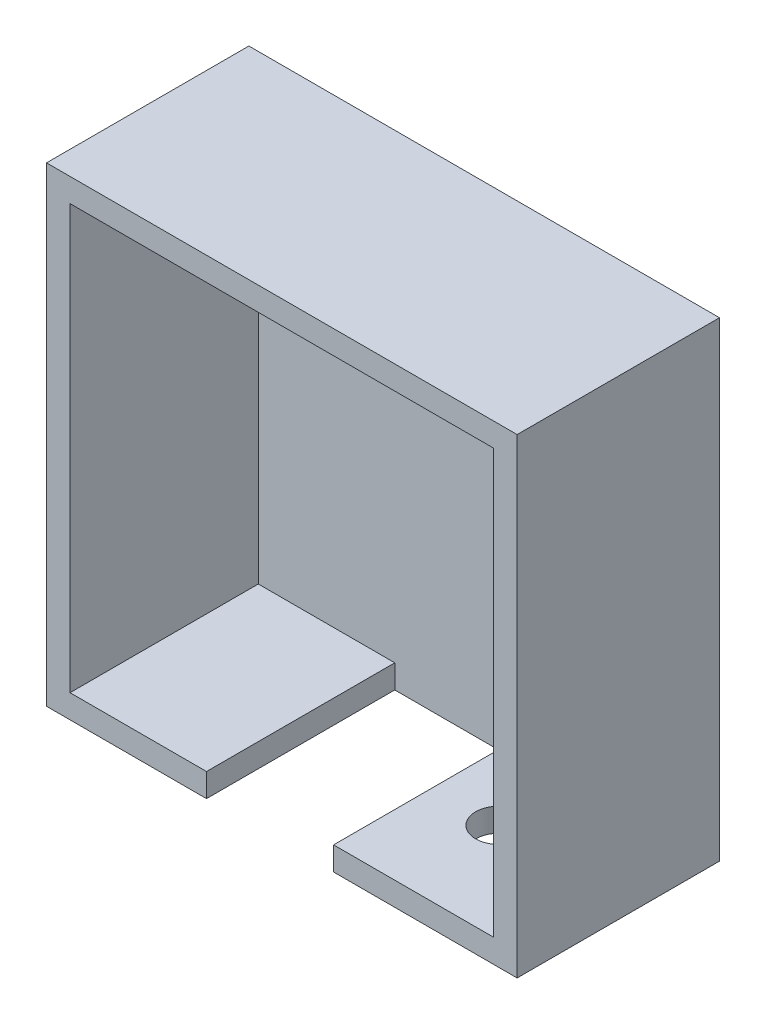
ISO-10303-21;
HEADER;
FILE_DESCRIPTION(('STEP AP214'),'2;1');
FILE_NAME('part.step','',(''),(''),'','','');
FILE_SCHEMA(('AUTOMOTIVE_DESIGN { 1 0 10303 214 1 1 1 1 }'));
ENDSEC;
DATA;
#1=APPLICATION_CONTEXT('core data for automotive mechanical design processes');
#2=APPLICATION_PROTOCOL_DEFINITION('international standard','automotive_design',2000,#1);
#3=PRODUCT_CONTEXT('',#1,'mechanical');
#4=PRODUCT('Part','Part','',(#3));
#5=PRODUCT_RELATED_PRODUCT_CATEGORY('part','',(#4));
#6=PRODUCT_DEFINITION_FORMATION('','',#4);
#7=PRODUCT_DEFINITION_CONTEXT('part definition',#1,'design');
#8=PRODUCT_DEFINITION('design','',#6,#7);
#9=PRODUCT_DEFINITION_SHAPE('','',#8);
#10=(LENGTH_UNIT() NAMED_UNIT(*) SI_UNIT(.MILLI.,.METRE.));
#11=(NAMED_UNIT(*) PLANE_ANGLE_UNIT() SI_UNIT($,.RADIAN.));
#12=(NAMED_UNIT(*) SI_UNIT($,.STERADIAN.) SOLID_ANGLE_UNIT());
#13=UNCERTAINTY_MEASURE_WITH_UNIT(LENGTH_MEASURE(1.E-05),#10,'distance_accuracy_value','');
#14=(GEOMETRIC_REPRESENTATION_CONTEXT(3) GLOBAL_UNCERTAINTY_ASSIGNED_CONTEXT((#13)) GLOBAL_UNIT_ASSIGNED_CONTEXT((#10,
#11,#12)) REPRESENTATION_CONTEXT('',''));
#15=CARTESIAN_POINT('',(0.,0.,0.));
#16=DIRECTION('',(0.,0.,1.));
#17=DIRECTION('',(1.,0.,0.));
#18=AXIS2_PLACEMENT_3D('',#15,#16,#17);
#19=CARTESIAN_POINT('',(0.,0.,3.));
#20=DIRECTION('',(1.,0.,0.));
#21=DIRECTION('',(0.,1.,0.));
#22=AXIS2_PLACEMENT_3D('',#19,#20,#21);
#23=PLANE('',#22);
#24=DIRECTION('',(0.,-1.,0.));
#25=VECTOR('',#24,1.);
#26=CARTESIAN_POINT('',(0.,0.,0.));
#27=LINE('',#26,#25);
#28=CARTESIAN_POINT('',(0.,0.,0.));
#29=VERTEX_POINT('',#28);
#30=CARTESIAN_POINT('',(0.,-100.,0.));
#31=VERTEX_POINT('',#30);
#32=EDGE_CURVE('E124',#29,#31,#27,.T.);
#33=ORIENTED_EDGE('',*,*,#32,.T.);
#34=DIRECTION('',(0.,0.,-1.));
#35=VECTOR('',#34,1.);
#36=CARTESIAN_POINT('',(0.,-100.,3.));
#37=LINE('',#36,#35);
#38=CARTESIAN_POINT('',(0.,-100.,43.));
#39=VERTEX_POINT('',#38);
#40=EDGE_CURVE('E11',#39,#31,#37,.T.);
#41=ORIENTED_EDGE('',*,*,#40,.F.);
#42=DIRECTION('',(0.,-1.,0.));
#43=VECTOR('',#42,1.);
#44=CARTESIAN_POINT('',(0.,0.,43.));
#45=LINE('',#44,#43);
#46=CARTESIAN_POINT('',(0.,0.,43.));
#47=VERTEX_POINT('',#46);
#48=EDGE_CURVE('E122',#47,#39,#45,.T.);
#49=ORIENTED_EDGE('',*,*,#48,.F.);
#50=DIRECTION('',(0.,0.,-1.));
#51=VECTOR('',#50,1.);
#52=CARTESIAN_POINT('',(0.,0.,3.));
#53=LINE('',#52,#51);
#54=EDGE_CURVE('E204',#47,#29,#53,.T.);
#55=ORIENTED_EDGE('',*,*,#54,.T.);
#56=EDGE_LOOP('',(#33,#41,#49,#55));
#57=FACE_BOUND('',#56,.T.);
#58=ADVANCED_FACE('F33',(#57),#23,.F.);
#59=CARTESIAN_POINT('',(0.,-100.,3.));
#60=DIRECTION('',(0.,1.,0.));
#61=DIRECTION('',(0.,0.,1.));
#62=AXIS2_PLACEMENT_3D('',#59,#60,#61);
#63=PLANE('',#62);
#64=CARTESIAN_POINT('',(75.,-100.,21.8065219628252));
#65=DIRECTION('',(0.,-1.,0.));
#66=DIRECTION('',(0.,0.,-1.));
#67=AXIS2_PLACEMENT_3D('',#64,#65,#66);
#68=CIRCLE('',#67,4.99999999999999);
#69=CARTESIAN_POINT('',(75.,-100.,16.8065219628252));
#70=VERTEX_POINT('',#69);
#71=EDGE_CURVE('E362',#70,#70,#68,.T.);
#72=ORIENTED_EDGE('',*,*,#71,.F.);
#73=EDGE_LOOP('',(#72));
#74=FACE_BOUND('',#73,.T.);
#75=DIRECTION('',(1.,0.,0.));
#76=VECTOR('',#75,1.);
#77=CARTESIAN_POINT('',(0.,-100.,0.));
#78=LINE('',#77,#76);
#79=CARTESIAN_POINT('',(100.,-100.,0.));
#80=VERTEX_POINT('',#79);
#81=EDGE_CURVE('E207',#31,#80,#78,.T.);
#82=ORIENTED_EDGE('',*,*,#81,.T.);
#83=DIRECTION('',(0.,0.,-1.));
#84=VECTOR('',#83,1.);
#85=CARTESIAN_POINT('',(100.,-100.,3.));
#86=LINE('',#85,#84);
#87=CARTESIAN_POINT('',(100.,-100.,43.));
#88=VERTEX_POINT('',#87);
#89=EDGE_CURVE('E41',#88,#80,#86,.T.);
#90=ORIENTED_EDGE('',*,*,#89,.F.);
#91=DIRECTION('',(1.,0.,0.));
#92=VECTOR('',#91,1.);
#93=CARTESIAN_POINT('',(61.,-100.,43.));
#94=LINE('',#93,#92);
#95=CARTESIAN_POINT('',(61.,-100.,43.));
#96=VERTEX_POINT('',#95);
#97=EDGE_CURVE('E158',#96,#88,#94,.T.);
#98=ORIENTED_EDGE('',*,*,#97,.F.);
#99=DIRECTION('',(0.,0.,-1.));
#100=VECTOR('',#99,1.);
#101=CARTESIAN_POINT('',(61.,-100.,43.));
#102=LINE('',#101,#100);
#103=CARTESIAN_POINT('',(61.,-100.,3.));
#104=VERTEX_POINT('',#103);
#105=EDGE_CURVE('E164',#96,#104,#102,.T.);
#106=ORIENTED_EDGE('',*,*,#105,.T.);
#107=DIRECTION('',(1.,0.,0.));
#108=VECTOR('',#107,1.);
#109=CARTESIAN_POINT('',(0.,-100.,3.));
#110=LINE('',#109,#108);
#111=CARTESIAN_POINT('',(34.,-100.,3.));
#112=VERTEX_POINT('',#111);
#113=EDGE_CURVE('E202',#112,#104,#110,.T.);
#114=ORIENTED_EDGE('',*,*,#113,.F.);
#115=DIRECTION('',(0.,0.,-1.));
#116=VECTOR('',#115,1.);
#117=CARTESIAN_POINT('',(34.,-100.,43.));
#118=LINE('',#117,#116);
#119=CARTESIAN_POINT('',(34.,-100.,43.));
#120=VERTEX_POINT('',#119);
#121=EDGE_CURVE('E139',#120,#112,#118,.T.);
#122=ORIENTED_EDGE('',*,*,#121,.F.);
#123=DIRECTION('',(1.,0.,0.));
#124=VECTOR('',#123,1.);
#125=CARTESIAN_POINT('',(0.,-100.,43.));
#126=LINE('',#125,#124);
#127=EDGE_CURVE('E130',#39,#120,#126,.T.);
#128=ORIENTED_EDGE('',*,*,#127,.F.);
#129=ORIENTED_EDGE('',*,*,#40,.T.);
#130=EDGE_LOOP('',(#82,#90,#98,#106,#114,#122,#128,#129));
#131=FACE_BOUND('',#130,.T.);
#132=ADVANCED_FACE('F136',(#74,#131),#63,.F.);
#133=CARTESIAN_POINT('',(100.,0.,3.));
#134=DIRECTION('',(-1.,0.,0.));
#135=DIRECTION('',(0.,0.,1.));
#136=AXIS2_PLACEMENT_3D('',#133,#134,#135);
#137=PLANE('',#136);
#138=DIRECTION('',(0.,1.,0.));
#139=VECTOR('',#138,1.);
#140=CARTESIAN_POINT('',(100.,0.,0.));
#141=LINE('',#140,#139);
#142=CARTESIAN_POINT('',(100.,0.,0.));
#143=VERTEX_POINT('',#142);
#144=EDGE_CURVE('E209',#80,#143,#141,.T.);
#145=ORIENTED_EDGE('',*,*,#144,.T.);
#146=DIRECTION('',(0.,0.,-1.));
#147=VECTOR('',#146,1.);
#148=CARTESIAN_POINT('',(100.,0.,3.));
#149=LINE('',#148,#147);
#150=CARTESIAN_POINT('',(100.,0.,43.));
#151=VERTEX_POINT('',#150);
#152=EDGE_CURVE('E213',#151,#143,#149,.T.);
#153=ORIENTED_EDGE('',*,*,#152,.F.);
#154=DIRECTION('',(0.,1.,0.));
#155=VECTOR('',#154,1.);
#156=CARTESIAN_POINT('',(100.,-5.00000000000001,43.));
#157=LINE('',#156,#155);
#158=EDGE_CURVE('E161',#88,#151,#157,.T.);
#159=ORIENTED_EDGE('',*,*,#158,.F.);
#160=ORIENTED_EDGE('',*,*,#89,.T.);
#161=EDGE_LOOP('',(#145,#153,#159,#160));
#162=FACE_BOUND('',#161,.T.);
#163=ADVANCED_FACE('F220',(#162),#137,.F.);
#164=CARTESIAN_POINT('',(0.,0.,3.));
#165=DIRECTION('',(0.,-1.,0.));
#166=DIRECTION('',(0.,0.,-1.));
#167=AXIS2_PLACEMENT_3D('',#164,#165,#166);
#168=PLANE('',#167);
#169=DIRECTION('',(-1.,0.,0.));
#170=VECTOR('',#169,1.);
#171=CARTESIAN_POINT('',(0.,0.,0.));
#172=LINE('',#171,#170);
#173=EDGE_CURVE('E205',#143,#29,#172,.T.);
#174=ORIENTED_EDGE('',*,*,#173,.T.);
#175=ORIENTED_EDGE('',*,*,#54,.F.);
#176=DIRECTION('',(-1.,0.,0.));
#177=VECTOR('',#176,1.);
#178=CARTESIAN_POINT('',(0.,0.,43.));
#179=LINE('',#178,#177);
#180=EDGE_CURVE('E134',#151,#47,#179,.T.);
#181=ORIENTED_EDGE('',*,*,#180,.F.);
#182=ORIENTED_EDGE('',*,*,#152,.T.);
#183=EDGE_LOOP('',(#174,#175,#181,#182));
#184=FACE_BOUND('',#183,.T.);
#185=ADVANCED_FACE('F226',(#184),#168,.F.);
#186=CARTESIAN_POINT('',(0.,0.,3.));
#187=DIRECTION('',(0.,0.,1.));
#188=DIRECTION('',(1.,0.,0.));
#189=AXIS2_PLACEMENT_3D('',#186,#187,#188);
#190=PLANE('',#189);
#191=DIRECTION('',(0.,-1.,0.));
#192=VECTOR('',#191,1.);
#193=CARTESIAN_POINT('',(61.,-95.,3.));
#194=LINE('',#193,#192);
#195=CARTESIAN_POINT('',(61.,-95.,3.));
#196=VERTEX_POINT('',#195);
#197=EDGE_CURVE('E48',#196,#104,#194,.T.);
#198=ORIENTED_EDGE('',*,*,#197,.F.);
#199=DIRECTION('',(-1.,0.,0.));
#200=VECTOR('',#199,1.);
#201=CARTESIAN_POINT('',(61.,-95.,3.));
#202=LINE('',#201,#200);
#203=CARTESIAN_POINT('',(95.,-95.,3.));
#204=VERTEX_POINT('',#203);
#205=EDGE_CURVE('E52',#204,#196,#202,.T.);
#206=ORIENTED_EDGE('',*,*,#205,.F.);
#207=DIRECTION('',(0.,-1.,0.));
#208=VECTOR('',#207,1.);
#209=CARTESIAN_POINT('',(95.,-5.,3.));
#210=LINE('',#209,#208);
#211=CARTESIAN_POINT('',(95.,-5.,3.));
#212=VERTEX_POINT('',#211);
#213=EDGE_CURVE('E177',#212,#204,#210,.T.);
#214=ORIENTED_EDGE('',*,*,#213,.F.);
#215=DIRECTION('',(1.,0.,0.));
#216=VECTOR('',#215,1.);
#217=CARTESIAN_POINT('',(5.,-5.,3.));
#218=LINE('',#217,#216);
#219=CARTESIAN_POINT('',(5.,-5.,3.));
#220=VERTEX_POINT('',#219);
#221=EDGE_CURVE('E174',#220,#212,#218,.T.);
#222=ORIENTED_EDGE('',*,*,#221,.F.);
#223=DIRECTION('',(0.,1.,0.));
#224=VECTOR('',#223,1.);
#225=CARTESIAN_POINT('',(5.,-5.,3.));
#226=LINE('',#225,#224);
#227=CARTESIAN_POINT('',(5.00000000000001,-95.,3.));
#228=VERTEX_POINT('',#227);
#229=EDGE_CURVE('E171',#228,#220,#226,.T.);
#230=ORIENTED_EDGE('',*,*,#229,.F.);
#231=DIRECTION('',(-1.,0.,0.));
#232=VECTOR('',#231,1.);
#233=CARTESIAN_POINT('',(5.00000000000001,-95.,3.));
#234=LINE('',#233,#232);
#235=CARTESIAN_POINT('',(34.,-95.,3.));
#236=VERTEX_POINT('',#235);
#237=EDGE_CURVE('E168',#236,#228,#234,.T.);
#238=ORIENTED_EDGE('',*,*,#237,.F.);
#239=DIRECTION('',(0.,1.,0.));
#240=VECTOR('',#239,1.);
#241=CARTESIAN_POINT('',(34.,-95.,3.));
#242=LINE('',#241,#240);
#243=EDGE_CURVE('E165',#112,#236,#242,.T.);
#244=ORIENTED_EDGE('',*,*,#243,.F.);
#245=ORIENTED_EDGE('',*,*,#113,.T.);
#246=EDGE_LOOP('',(#198,#206,#214,#222,#230,#238,#244,#245));
#247=FACE_BOUND('',#246,.T.);
#248=ADVANCED_FACE('F240',(#247),#190,.T.);
#249=CARTESIAN_POINT('',(0.,0.,0.));
#250=DIRECTION('',(0.,0.,1.));
#251=DIRECTION('',(1.,0.,0.));
#252=AXIS2_PLACEMENT_3D('',#249,#250,#251);
#253=PLANE('',#252);
#254=ORIENTED_EDGE('',*,*,#32,.F.);
#255=ORIENTED_EDGE('',*,*,#173,.F.);
#256=ORIENTED_EDGE('',*,*,#144,.F.);
#257=ORIENTED_EDGE('',*,*,#81,.F.);
#258=EDGE_LOOP('',(#254,#255,#256,#257));
#259=FACE_BOUND('',#258,.T.);
#260=ADVANCED_FACE('F224',(#259),#253,.F.);
#261=CARTESIAN_POINT('',(34.,-95.,43.));
#262=DIRECTION('',(-1.,0.,0.));
#263=DIRECTION('',(0.,0.,1.));
#264=AXIS2_PLACEMENT_3D('',#261,#262,#263);
#265=PLANE('',#264);
#266=ORIENTED_EDGE('',*,*,#243,.T.);
#267=DIRECTION('',(0.,0.,-1.));
#268=VECTOR('',#267,1.);
#269=CARTESIAN_POINT('',(34.,-95.,43.));
#270=LINE('',#269,#268);
#271=CARTESIAN_POINT('',(34.,-95.,43.));
#272=VERTEX_POINT('',#271);
#273=EDGE_CURVE('E198',#272,#236,#270,.T.);
#274=ORIENTED_EDGE('',*,*,#273,.F.);
#275=DIRECTION('',(0.,1.,0.));
#276=VECTOR('',#275,1.);
#277=CARTESIAN_POINT('',(34.,-95.,43.));
#278=LINE('',#277,#276);
#279=EDGE_CURVE('E141',#120,#272,#278,.T.);
#280=ORIENTED_EDGE('',*,*,#279,.F.);
#281=ORIENTED_EDGE('',*,*,#121,.T.);
#282=EDGE_LOOP('',(#266,#274,#280,#281));
#283=FACE_BOUND('',#282,.T.);
#284=ADVANCED_FACE('F254',(#283),#265,.F.);
#285=CARTESIAN_POINT('',(5.00000000000001,-95.,43.));
#286=DIRECTION('',(0.,-1.,0.));
#287=DIRECTION('',(0.,0.,-1.));
#288=AXIS2_PLACEMENT_3D('',#285,#286,#287);
#289=PLANE('',#288);
#290=ORIENTED_EDGE('',*,*,#237,.T.);
#291=DIRECTION('',(0.,0.,-1.));
#292=VECTOR('',#291,1.);
#293=CARTESIAN_POINT('',(5.00000000000001,-95.,43.));
#294=LINE('',#293,#292);
#295=CARTESIAN_POINT('',(5.00000000000001,-95.,43.));
#296=VERTEX_POINT('',#295);
#297=EDGE_CURVE('E195',#296,#228,#294,.T.);
#298=ORIENTED_EDGE('',*,*,#297,.F.);
#299=DIRECTION('',(-1.,0.,0.));
#300=VECTOR('',#299,1.);
#301=CARTESIAN_POINT('',(5.00000000000001,-95.,43.));
#302=LINE('',#301,#300);
#303=EDGE_CURVE('E143',#272,#296,#302,.T.);
#304=ORIENTED_EDGE('',*,*,#303,.F.);
#305=ORIENTED_EDGE('',*,*,#273,.T.);
#306=EDGE_LOOP('',(#290,#298,#304,#305));
#307=FACE_BOUND('',#306,.T.);
#308=ADVANCED_FACE('F250',(#307),#289,.F.);
#309=CARTESIAN_POINT('',(5.,-5.,43.));
#310=DIRECTION('',(-1.,0.,0.));
#311=DIRECTION('',(0.,-1.,0.));
#312=AXIS2_PLACEMENT_3D('',#309,#310,#311);
#313=PLANE('',#312);
#314=ORIENTED_EDGE('',*,*,#229,.T.);
#315=DIRECTION('',(0.,0.,-1.));
#316=VECTOR('',#315,1.);
#317=CARTESIAN_POINT('',(5.,-5.,43.));
#318=LINE('',#317,#316);
#319=CARTESIAN_POINT('',(5.,-5.,43.));
#320=VERTEX_POINT('',#319);
#321=EDGE_CURVE('E192',#320,#220,#318,.T.);
#322=ORIENTED_EDGE('',*,*,#321,.F.);
#323=DIRECTION('',(0.,1.,0.));
#324=VECTOR('',#323,1.);
#325=CARTESIAN_POINT('',(5.,-5.,43.));
#326=LINE('',#325,#324);
#327=EDGE_CURVE('E148',#296,#320,#326,.T.);
#328=ORIENTED_EDGE('',*,*,#327,.F.);
#329=ORIENTED_EDGE('',*,*,#297,.T.);
#330=EDGE_LOOP('',(#314,#322,#328,#329));
#331=FACE_BOUND('',#330,.T.);
#332=ADVANCED_FACE('F247',(#331),#313,.F.);
#333=CARTESIAN_POINT('',(5.,-5.,43.));
#334=DIRECTION('',(0.,1.,0.));
#335=DIRECTION('',(0.,0.,1.));
#336=AXIS2_PLACEMENT_3D('',#333,#334,#335);
#337=PLANE('',#336);
#338=ORIENTED_EDGE('',*,*,#221,.T.);
#339=DIRECTION('',(0.,0.,-1.));
#340=VECTOR('',#339,1.);
#341=CARTESIAN_POINT('',(95.,-5.,43.));
#342=LINE('',#341,#340);
#343=CARTESIAN_POINT('',(95.,-5.,43.));
#344=VERTEX_POINT('',#343);
#345=EDGE_CURVE('E189',#344,#212,#342,.T.);
#346=ORIENTED_EDGE('',*,*,#345,.F.);
#347=DIRECTION('',(1.,0.,0.));
#348=VECTOR('',#347,1.);
#349=CARTESIAN_POINT('',(5.,-5.,43.));
#350=LINE('',#349,#348);
#351=EDGE_CURVE('E150',#320,#344,#350,.T.);
#352=ORIENTED_EDGE('',*,*,#351,.F.);
#353=ORIENTED_EDGE('',*,*,#321,.T.);
#354=EDGE_LOOP('',(#338,#346,#352,#353));
#355=FACE_BOUND('',#354,.T.);
#356=ADVANCED_FACE('F242',(#355),#337,.F.);
#357=CARTESIAN_POINT('',(95.,-5.,43.));
#358=DIRECTION('',(1.,0.,0.));
#359=DIRECTION('',(0.,0.,-1.));
#360=AXIS2_PLACEMENT_3D('',#357,#358,#359);
#361=PLANE('',#360);
#362=ORIENTED_EDGE('',*,*,#213,.T.);
#363=DIRECTION('',(0.,0.,-1.));
#364=VECTOR('',#363,1.);
#365=CARTESIAN_POINT('',(95.,-95.,43.));
#366=LINE('',#365,#364);
#367=CARTESIAN_POINT('',(95.,-95.,43.));
#368=VERTEX_POINT('',#367);
#369=EDGE_CURVE('E186',#368,#204,#366,.T.);
#370=ORIENTED_EDGE('',*,*,#369,.F.);
#371=DIRECTION('',(0.,-1.,0.));
#372=VECTOR('',#371,1.);
#373=CARTESIAN_POINT('',(95.,-5.,43.));
#374=LINE('',#373,#372);
#375=EDGE_CURVE('E152',#344,#368,#374,.T.);
#376=ORIENTED_EDGE('',*,*,#375,.F.);
#377=ORIENTED_EDGE('',*,*,#345,.T.);
#378=EDGE_LOOP('',(#362,#370,#376,#377));
#379=FACE_BOUND('',#378,.T.);
#380=ADVANCED_FACE('F238',(#379),#361,.F.);
#381=CARTESIAN_POINT('',(61.,-95.,43.));
#382=DIRECTION('',(0.,-1.,0.));
#383=DIRECTION('',(0.,0.,-1.));
#384=AXIS2_PLACEMENT_3D('',#381,#382,#383);
#385=PLANE('',#384);
#386=CARTESIAN_POINT('',(75.,-95.,21.8065219628252));
#387=DIRECTION('',(0.,-1.,0.));
#388=DIRECTION('',(0.,0.,-1.));
#389=AXIS2_PLACEMENT_3D('',#386,#387,#388);
#390=CIRCLE('',#389,4.99999999999999);
#391=CARTESIAN_POINT('',(75.,-95.,16.8065219628252));
#392=VERTEX_POINT('',#391);
#393=EDGE_CURVE('E36',#392,#392,#390,.T.);
#394=ORIENTED_EDGE('',*,*,#393,.T.);
#395=EDGE_LOOP('',(#394));
#396=FACE_BOUND('',#395,.T.);
#397=ORIENTED_EDGE('',*,*,#205,.T.);
#398=DIRECTION('',(0.,0.,-1.));
#399=VECTOR('',#398,1.);
#400=CARTESIAN_POINT('',(61.,-95.,43.));
#401=LINE('',#400,#399);
#402=CARTESIAN_POINT('',(61.,-95.,43.));
#403=VERTEX_POINT('',#402);
#404=EDGE_CURVE('E183',#403,#196,#401,.T.);
#405=ORIENTED_EDGE('',*,*,#404,.F.);
#406=DIRECTION('',(-1.,0.,0.));
#407=VECTOR('',#406,1.);
#408=CARTESIAN_POINT('',(61.,-95.,43.));
#409=LINE('',#408,#407);
#410=EDGE_CURVE('E154',#368,#403,#409,.T.);
#411=ORIENTED_EDGE('',*,*,#410,.F.);
#412=ORIENTED_EDGE('',*,*,#369,.T.);
#413=EDGE_LOOP('',(#397,#405,#411,#412));
#414=FACE_BOUND('',#413,.T.);
#415=ADVANCED_FACE('F234',(#396,#414),#385,.F.);
#416=CARTESIAN_POINT('',(61.,-95.,43.));
#417=DIRECTION('',(1.,0.,0.));
#418=DIRECTION('',(0.,0.,-1.));
#419=AXIS2_PLACEMENT_3D('',#416,#417,#418);
#420=PLANE('',#419);
#421=ORIENTED_EDGE('',*,*,#197,.T.);
#422=ORIENTED_EDGE('',*,*,#105,.F.);
#423=DIRECTION('',(0.,-1.,0.));
#424=VECTOR('',#423,1.);
#425=CARTESIAN_POINT('',(61.,-95.,43.));
#426=LINE('',#425,#424);
#427=EDGE_CURVE('E156',#403,#96,#426,.T.);
#428=ORIENTED_EDGE('',*,*,#427,.F.);
#429=ORIENTED_EDGE('',*,*,#404,.T.);
#430=EDGE_LOOP('',(#421,#422,#428,#429));
#431=FACE_BOUND('',#430,.T.);
#432=ADVANCED_FACE('F230',(#431),#420,.F.);
#433=CARTESIAN_POINT('',(0.,0.,43.));
#434=DIRECTION('',(0.,0.,1.));
#435=DIRECTION('',(1.,0.,0.));
#436=AXIS2_PLACEMENT_3D('',#433,#434,#435);
#437=PLANE('',#436);
#438=ORIENTED_EDGE('',*,*,#48,.T.);
#439=ORIENTED_EDGE('',*,*,#127,.T.);
#440=ORIENTED_EDGE('',*,*,#279,.T.);
#441=ORIENTED_EDGE('',*,*,#303,.T.);
#442=ORIENTED_EDGE('',*,*,#327,.T.);
#443=ORIENTED_EDGE('',*,*,#351,.T.);
#444=ORIENTED_EDGE('',*,*,#375,.T.);
#445=ORIENTED_EDGE('',*,*,#410,.T.);
#446=ORIENTED_EDGE('',*,*,#427,.T.);
#447=ORIENTED_EDGE('',*,*,#97,.T.);
#448=ORIENTED_EDGE('',*,*,#158,.T.);
#449=ORIENTED_EDGE('',*,*,#180,.T.);
#450=EDGE_LOOP('',(#438,#439,#440,#441,#442,#443,#444,#445,#446,#447,#448,#449));
#451=FACE_BOUND('',#450,.T.);
#452=ADVANCED_FACE('F129',(#451),#437,.T.);
#453=CARTESIAN_POINT('',(75.,-60.,21.8065219628252));
#454=DIRECTION('',(0.,-1.,0.));
#455=DIRECTION('',(0.,0.,-1.));
#456=AXIS2_PLACEMENT_3D('',#453,#454,#455);
#457=CYLINDRICAL_SURFACE('',#456,4.99999999999999);
#458=ORIENTED_EDGE('',*,*,#71,.T.);
#459=EDGE_LOOP('',(#458));
#460=FACE_BOUND('',#459,.T.);
#461=ORIENTED_EDGE('',*,*,#393,.F.);
#462=EDGE_LOOP('',(#461));
#463=FACE_BOUND('',#462,.T.);
#464=ADVANCED_FACE('F333',(#460,#463),#457,.F.);
#465=CLOSED_SHELL('',(#58,#132,#163,#185,#248,#260,#284,#308,#332,#356,#380,#415,#432,#452,#464));
#466=MANIFOLD_SOLID_BREP('B2',#465);
#467=ADVANCED_BREP_SHAPE_REPRESENTATION('',(#18,#466),#14);
#468=SHAPE_DEFINITION_REPRESENTATION(#9,#467);
ENDSEC;
END-ISO-10303-21;
